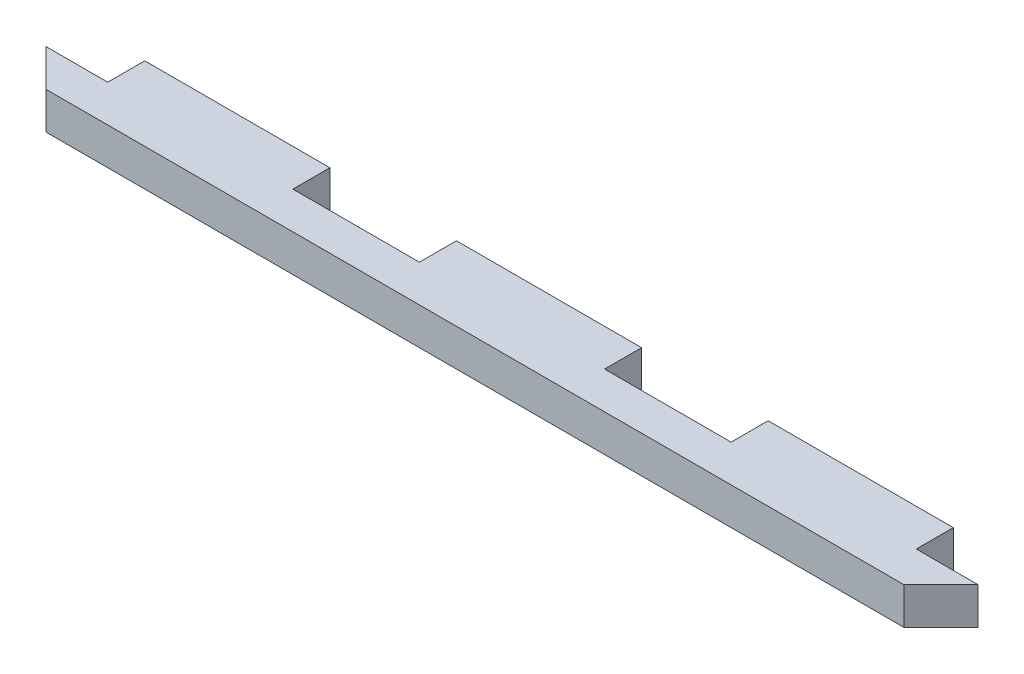
ISO-10303-21;
HEADER;
FILE_DESCRIPTION(('STEP AP214'),'2;1');
FILE_NAME('part.step','',(''),(''),'','','');
FILE_SCHEMA(('AUTOMOTIVE_DESIGN { 1 0 10303 214 1 1 1 1 }'));
ENDSEC;
DATA;
#1=APPLICATION_CONTEXT('core data for automotive mechanical design processes');
#2=APPLICATION_PROTOCOL_DEFINITION('international standard','automotive_design',2000,#1);
#3=PRODUCT_CONTEXT('',#1,'mechanical');
#4=PRODUCT('Part','Part','',(#3));
#5=PRODUCT_RELATED_PRODUCT_CATEGORY('part','',(#4));
#6=PRODUCT_DEFINITION_FORMATION('','',#4);
#7=PRODUCT_DEFINITION_CONTEXT('part definition',#1,'design');
#8=PRODUCT_DEFINITION('design','',#6,#7);
#9=PRODUCT_DEFINITION_SHAPE('','',#8);
#10=(LENGTH_UNIT() NAMED_UNIT(*) SI_UNIT(.MILLI.,.METRE.));
#11=(NAMED_UNIT(*) PLANE_ANGLE_UNIT() SI_UNIT($,.RADIAN.));
#12=(NAMED_UNIT(*) SI_UNIT($,.STERADIAN.) SOLID_ANGLE_UNIT());
#13=UNCERTAINTY_MEASURE_WITH_UNIT(LENGTH_MEASURE(1.E-05),#10,'distance_accuracy_value','');
#14=(GEOMETRIC_REPRESENTATION_CONTEXT(3) GLOBAL_UNCERTAINTY_ASSIGNED_CONTEXT((#13)) GLOBAL_UNIT_ASSIGNED_CONTEXT((#10,
#11,#12)) REPRESENTATION_CONTEXT('',''));
#15=CARTESIAN_POINT('',(0.,0.,0.));
#16=DIRECTION('',(0.,0.,1.));
#17=DIRECTION('',(1.,0.,0.));
#18=AXIS2_PLACEMENT_3D('',#15,#16,#17);
#19=CARTESIAN_POINT('',(0.,6.,-3.));
#20=DIRECTION('',(0.,0.,-1.));
#21=DIRECTION('',(-1.,0.,0.));
#22=AXIS2_PLACEMENT_3D('',#19,#20,#21);
#23=PLANE('',#22);
#24=DIRECTION('',(1.,0.,0.));
#25=VECTOR('',#24,1.);
#26=CARTESIAN_POINT('',(0.,0.,-3.));
#27=LINE('',#26,#25);
#28=CARTESIAN_POINT('',(-35.5,0.,-3.00000000000002));
#29=VERTEX_POINT('',#28);
#30=CARTESIAN_POINT('',(-15.,0.,-3.00000000000001));
#31=VERTEX_POINT('',#30);
#32=EDGE_CURVE('E268',#29,#31,#27,.T.);
#33=ORIENTED_EDGE('',*,*,#32,.F.);
#34=DIRECTION('',(0.,-1.,0.));
#35=VECTOR('',#34,1.);
#36=CARTESIAN_POINT('',(-35.5,36.5941170815567,-3.00000000000002));
#37=LINE('',#36,#35);
#38=CARTESIAN_POINT('',(-35.5,6.00000000000001,-3.00000000000002));
#39=VERTEX_POINT('',#38);
#40=EDGE_CURVE('E247',#39,#29,#37,.T.);
#41=ORIENTED_EDGE('',*,*,#40,.F.);
#42=DIRECTION('',(1.,0.,0.));
#43=VECTOR('',#42,1.);
#44=CARTESIAN_POINT('',(0.,6.,-3.));
#45=LINE('',#44,#43);
#46=CARTESIAN_POINT('',(-15.,6.00000000000001,-3.00000000000001));
#47=VERTEX_POINT('',#46);
#48=EDGE_CURVE('E179',#39,#47,#45,.T.);
#49=ORIENTED_EDGE('',*,*,#48,.T.);
#50=DIRECTION('',(0.,-1.,0.));
#51=VECTOR('',#50,1.);
#52=CARTESIAN_POINT('',(-15.,36.5941170815567,-3.00000000000001));
#53=LINE('',#52,#51);
#54=EDGE_CURVE('E215',#47,#31,#53,.T.);
#55=ORIENTED_EDGE('',*,*,#54,.T.);
#56=EDGE_LOOP('',(#33,#41,#49,#55));
#57=FACE_BOUND('',#56,.T.);
#58=ADVANCED_FACE('F39',(#57),#23,.T.);
#59=CARTESIAN_POINT('',(15.,0.,-2.99999999999999));
#60=VERTEX_POINT('',#59);
#61=CARTESIAN_POINT('',(35.5,0.,-2.99999999999998));
#62=VERTEX_POINT('',#61);
#63=EDGE_CURVE('E272',#60,#62,#27,.T.);
#64=ORIENTED_EDGE('',*,*,#63,.F.);
#65=DIRECTION('',(0.,-1.,0.));
#66=VECTOR('',#65,1.);
#67=CARTESIAN_POINT('',(15.,36.5941170815567,-2.99999999999999));
#68=LINE('',#67,#66);
#69=CARTESIAN_POINT('',(15.,6.00000000000001,-2.99999999999999));
#70=VERTEX_POINT('',#69);
#71=EDGE_CURVE('E232',#70,#60,#68,.T.);
#72=ORIENTED_EDGE('',*,*,#71,.F.);
#73=CARTESIAN_POINT('',(35.5,6.,-2.99999999999998));
#74=VERTEX_POINT('',#73);
#75=EDGE_CURVE('E184',#70,#74,#45,.T.);
#76=ORIENTED_EDGE('',*,*,#75,.T.);
#77=DIRECTION('',(0.,-1.,0.));
#78=VECTOR('',#77,1.);
#79=CARTESIAN_POINT('',(35.5,36.5941170815567,-2.99999999999998));
#80=LINE('',#79,#78);
#81=EDGE_CURVE('E196',#74,#62,#80,.T.);
#82=ORIENTED_EDGE('',*,*,#81,.T.);
#83=EDGE_LOOP('',(#64,#72,#76,#82));
#84=FACE_BOUND('',#83,.T.);
#85=ADVANCED_FACE('F304',(#84),#23,.T.);
#86=DIRECTION('',(0.,-1.,0.));
#87=VECTOR('',#86,1.);
#88=CARTESIAN_POINT('',(-65.5,36.5941170815567,-3.00000000000003));
#89=LINE('',#88,#87);
#90=CARTESIAN_POINT('',(-65.5,6.00000000000001,-3.00000000000003));
#91=VERTEX_POINT('',#90);
#92=CARTESIAN_POINT('',(-65.5,0.,-3.00000000000003));
#93=VERTEX_POINT('',#92);
#94=EDGE_CURVE('E152',#91,#93,#89,.T.);
#95=ORIENTED_EDGE('',*,*,#94,.T.);
#96=CARTESIAN_POINT('',(-75.5,0.,-3.00000000000004));
#97=VERTEX_POINT('',#96);
#98=EDGE_CURVE('E271',#97,#93,#27,.T.);
#99=ORIENTED_EDGE('',*,*,#98,.F.);
#100=DIRECTION('',(0.,-1.,0.));
#101=VECTOR('',#100,1.);
#102=CARTESIAN_POINT('',(-75.5,6.,-3.00000000000004));
#103=LINE('',#102,#101);
#104=CARTESIAN_POINT('',(-75.5,6.,-3.00000000000004));
#105=VERTEX_POINT('',#104);
#106=EDGE_CURVE('E176',#105,#97,#103,.T.);
#107=ORIENTED_EDGE('',*,*,#106,.F.);
#108=EDGE_CURVE('E170',#105,#91,#45,.T.);
#109=ORIENTED_EDGE('',*,*,#108,.T.);
#110=EDGE_LOOP('',(#95,#99,#107,#109));
#111=FACE_BOUND('',#110,.T.);
#112=ADVANCED_FACE('F175',(#111),#23,.T.);
#113=CARTESIAN_POINT('',(0.,6.,2.99999999999996));
#114=DIRECTION('',(0.,0.,-1.));
#115=DIRECTION('',(-1.,0.,0.));
#116=AXIS2_PLACEMENT_3D('',#113,#114,#115);
#117=PLANE('',#116);
#118=DIRECTION('',(1.,0.,0.));
#119=VECTOR('',#118,1.);
#120=CARTESIAN_POINT('',(0.,0.,2.99999999999996));
#121=LINE('',#120,#119);
#122=CARTESIAN_POINT('',(-69.5,0.,2.99999999999996));
#123=VERTEX_POINT('',#122);
#124=CARTESIAN_POINT('',(69.5000000000001,0.,2.99999999999996));
#125=VERTEX_POINT('',#124);
#126=EDGE_CURVE('E199',#123,#125,#121,.T.);
#127=ORIENTED_EDGE('',*,*,#126,.T.);
#128=DIRECTION('',(0.,-1.,0.));
#129=VECTOR('',#128,1.);
#130=CARTESIAN_POINT('',(69.5000000000001,6.,2.99999999999996));
#131=LINE('',#130,#129);
#132=CARTESIAN_POINT('',(69.5000000000001,6.,2.99999999999996));
#133=VERTEX_POINT('',#132);
#134=EDGE_CURVE('E11',#133,#125,#131,.T.);
#135=ORIENTED_EDGE('',*,*,#134,.F.);
#136=DIRECTION('',(1.,0.,0.));
#137=VECTOR('',#136,1.);
#138=CARTESIAN_POINT('',(0.,6.,2.99999999999996));
#139=LINE('',#138,#137);
#140=CARTESIAN_POINT('',(-69.5,6.,2.99999999999996));
#141=VERTEX_POINT('',#140);
#142=EDGE_CURVE('E191',#141,#133,#139,.T.);
#143=ORIENTED_EDGE('',*,*,#142,.F.);
#144=DIRECTION('',(0.,-1.,0.));
#145=VECTOR('',#144,1.);
#146=CARTESIAN_POINT('',(-69.5,6.,2.99999999999996));
#147=LINE('',#146,#145);
#148=EDGE_CURVE('E182',#141,#123,#147,.T.);
#149=ORIENTED_EDGE('',*,*,#148,.T.);
#150=EDGE_LOOP('',(#127,#135,#143,#149));
#151=FACE_BOUND('',#150,.T.);
#152=ADVANCED_FACE('F41',(#151),#117,.F.);
#153=CARTESIAN_POINT('',(36.25,6.,36.25));
#154=DIRECTION('',(-0.707106781186547,0.,-0.707106781186548));
#155=DIRECTION('',(-0.707106781186548,0.,0.707106781186547));
#156=AXIS2_PLACEMENT_3D('',#153,#154,#155);
#157=PLANE('',#156);
#158=DIRECTION('',(0.707106781186548,0.,-0.707106781186547));
#159=VECTOR('',#158,1.);
#160=CARTESIAN_POINT('',(36.25,0.,36.25));
#161=LINE('',#160,#159);
#162=CARTESIAN_POINT('',(75.5,0.,-2.99999999999996));
#163=VERTEX_POINT('',#162);
#164=EDGE_CURVE('E277',#125,#163,#161,.T.);
#165=ORIENTED_EDGE('',*,*,#164,.T.);
#166=DIRECTION('',(0.,-1.,0.));
#167=VECTOR('',#166,1.);
#168=CARTESIAN_POINT('',(75.5,6.,-2.99999999999996));
#169=LINE('',#168,#167);
#170=CARTESIAN_POINT('',(75.5,6.,-2.99999999999996));
#171=VERTEX_POINT('',#170);
#172=EDGE_CURVE('E47',#171,#163,#169,.T.);
#173=ORIENTED_EDGE('',*,*,#172,.F.);
#174=DIRECTION('',(0.707106781186548,0.,-0.707106781186547));
#175=VECTOR('',#174,1.);
#176=CARTESIAN_POINT('',(36.25,6.,36.25));
#177=LINE('',#176,#175);
#178=EDGE_CURVE('E186',#133,#171,#177,.T.);
#179=ORIENTED_EDGE('',*,*,#178,.F.);
#180=ORIENTED_EDGE('',*,*,#134,.T.);
#181=EDGE_LOOP('',(#165,#173,#179,#180));
#182=FACE_BOUND('',#181,.T.);
#183=ADVANCED_FACE('F285',(#182),#157,.F.);
#184=DIRECTION('',(0.,-1.,0.));
#185=VECTOR('',#184,1.);
#186=CARTESIAN_POINT('',(65.5,36.5941170815567,-2.99999999999997));
#187=LINE('',#186,#185);
#188=CARTESIAN_POINT('',(65.5,6.,-2.99999999999997));
#189=VERTEX_POINT('',#188);
#190=CARTESIAN_POINT('',(65.5,0.,-2.99999999999997));
#191=VERTEX_POINT('',#190);
#192=EDGE_CURVE('E207',#189,#191,#187,.T.);
#193=ORIENTED_EDGE('',*,*,#192,.F.);
#194=EDGE_CURVE('E181',#189,#171,#45,.T.);
#195=ORIENTED_EDGE('',*,*,#194,.T.);
#196=ORIENTED_EDGE('',*,*,#172,.T.);
#197=EDGE_CURVE('E274',#191,#163,#27,.T.);
#198=ORIENTED_EDGE('',*,*,#197,.F.);
#199=EDGE_LOOP('',(#193,#195,#196,#198));
#200=FACE_BOUND('',#199,.T.);
#201=ADVANCED_FACE('F283',(#200),#23,.T.);
#202=CARTESIAN_POINT('',(-36.25,6.,36.25));
#203=DIRECTION('',(0.707106781186548,0.,-0.707106781186548));
#204=DIRECTION('',(-0.707106781186548,0.,-0.707106781186548));
#205=AXIS2_PLACEMENT_3D('',#202,#203,#204);
#206=PLANE('',#205);
#207=DIRECTION('',(0.707106781186548,0.,0.707106781186547));
#208=VECTOR('',#207,1.);
#209=CARTESIAN_POINT('',(-36.25,0.,36.25));
#210=LINE('',#209,#208);
#211=EDGE_CURVE('E193',#97,#123,#210,.T.);
#212=ORIENTED_EDGE('',*,*,#211,.T.);
#213=ORIENTED_EDGE('',*,*,#148,.F.);
#214=DIRECTION('',(0.707106781186548,0.,0.707106781186547));
#215=VECTOR('',#214,1.);
#216=CARTESIAN_POINT('',(-36.25,6.,36.25));
#217=LINE('',#216,#215);
#218=EDGE_CURVE('E178',#105,#141,#217,.T.);
#219=ORIENTED_EDGE('',*,*,#218,.F.);
#220=ORIENTED_EDGE('',*,*,#106,.T.);
#221=EDGE_LOOP('',(#212,#213,#219,#220));
#222=FACE_BOUND('',#221,.T.);
#223=ADVANCED_FACE('F293',(#222),#206,.F.);
#224=CARTESIAN_POINT('',(0.,6.,0.));
#225=DIRECTION('',(0.,1.,0.));
#226=DIRECTION('',(0.,0.,1.));
#227=AXIS2_PLACEMENT_3D('',#224,#225,#226);
#228=PLANE('',#227);
#229=ORIENTED_EDGE('',*,*,#142,.T.);
#230=ORIENTED_EDGE('',*,*,#178,.T.);
#231=ORIENTED_EDGE('',*,*,#194,.F.);
#232=DIRECTION('',(0.,0.,-1.));
#233=VECTOR('',#232,1.);
#234=CARTESIAN_POINT('',(65.5,6.00000000000001,0.));
#235=LINE('',#234,#233);
#236=CARTESIAN_POINT('',(65.5,6.00000000000001,-9.00000000000004));
#237=VERTEX_POINT('',#236);
#238=EDGE_CURVE('E213',#189,#237,#235,.T.);
#239=ORIENTED_EDGE('',*,*,#238,.T.);
#240=DIRECTION('',(-1.,0.,0.));
#241=VECTOR('',#240,1.);
#242=CARTESIAN_POINT('',(0.,6.00000000000001,-9.00000000000004));
#243=LINE('',#242,#241);
#244=CARTESIAN_POINT('',(35.5,6.00000000000001,-9.00000000000004));
#245=VERTEX_POINT('',#244);
#246=EDGE_CURVE('E210',#237,#245,#243,.T.);
#247=ORIENTED_EDGE('',*,*,#246,.T.);
#248=DIRECTION('',(0.,0.,-1.));
#249=VECTOR('',#248,1.);
#250=CARTESIAN_POINT('',(35.5,6.00000000000001,0.));
#251=LINE('',#250,#249);
#252=EDGE_CURVE('E204',#74,#245,#251,.T.);
#253=ORIENTED_EDGE('',*,*,#252,.F.);
#254=ORIENTED_EDGE('',*,*,#75,.F.);
#255=DIRECTION('',(0.,0.,-1.));
#256=VECTOR('',#255,1.);
#257=CARTESIAN_POINT('',(15.,6.00000000000001,0.));
#258=LINE('',#257,#256);
#259=CARTESIAN_POINT('',(15.,6.00000000000001,-9.00000000000004));
#260=VERTEX_POINT('',#259);
#261=EDGE_CURVE('E237',#70,#260,#258,.T.);
#262=ORIENTED_EDGE('',*,*,#261,.T.);
#263=DIRECTION('',(-1.,0.,0.));
#264=VECTOR('',#263,1.);
#265=CARTESIAN_POINT('',(0.,6.00000000000001,-9.00000000000004));
#266=LINE('',#265,#264);
#267=CARTESIAN_POINT('',(-15.,6.00000000000001,-9.00000000000004));
#268=VERTEX_POINT('',#267);
#269=EDGE_CURVE('E234',#260,#268,#266,.T.);
#270=ORIENTED_EDGE('',*,*,#269,.T.);
#271=DIRECTION('',(0.,0.,-1.));
#272=VECTOR('',#271,1.);
#273=CARTESIAN_POINT('',(-15.,6.00000000000001,0.));
#274=LINE('',#273,#272);
#275=EDGE_CURVE('E229',#47,#268,#274,.T.);
#276=ORIENTED_EDGE('',*,*,#275,.F.);
#277=ORIENTED_EDGE('',*,*,#48,.F.);
#278=DIRECTION('',(0.,0.,-1.));
#279=VECTOR('',#278,1.);
#280=CARTESIAN_POINT('',(-35.5,6.00000000000001,0.));
#281=LINE('',#280,#279);
#282=CARTESIAN_POINT('',(-35.5,6.00000000000001,-9.00000000000005));
#283=VERTEX_POINT('',#282);
#284=EDGE_CURVE('E239',#39,#283,#281,.T.);
#285=ORIENTED_EDGE('',*,*,#284,.T.);
#286=DIRECTION('',(1.,0.,0.));
#287=VECTOR('',#286,1.);
#288=CARTESIAN_POINT('',(0.,6.00000000000001,-9.00000000000005));
#289=LINE('',#288,#287);
#290=CARTESIAN_POINT('',(-65.5,6.00000000000001,-9.00000000000005));
#291=VERTEX_POINT('',#290);
#292=EDGE_CURVE('E172',#291,#283,#289,.T.);
#293=ORIENTED_EDGE('',*,*,#292,.F.);
#294=DIRECTION('',(0.,0.,-1.));
#295=VECTOR('',#294,1.);
#296=CARTESIAN_POINT('',(-65.5,6.00000000000001,0.));
#297=LINE('',#296,#295);
#298=EDGE_CURVE('E155',#91,#291,#297,.T.);
#299=ORIENTED_EDGE('',*,*,#298,.F.);
#300=ORIENTED_EDGE('',*,*,#108,.F.);
#301=ORIENTED_EDGE('',*,*,#218,.T.);
#302=EDGE_LOOP('',(#229,#230,#231,#239,#247,#253,#254,#262,#270,#276,#277,#285,#293,#299,#300,#301));
#303=FACE_BOUND('',#302,.T.);
#304=ADVANCED_FACE('F169',(#303),#228,.T.);
#305=CARTESIAN_POINT('',(0.,0.,0.));
#306=DIRECTION('',(0.,1.,0.));
#307=DIRECTION('',(0.,0.,1.));
#308=AXIS2_PLACEMENT_3D('',#305,#306,#307);
#309=PLANE('',#308);
#310=ORIENTED_EDGE('',*,*,#126,.F.);
#311=ORIENTED_EDGE('',*,*,#211,.F.);
#312=ORIENTED_EDGE('',*,*,#98,.T.);
#313=DIRECTION('',(0.,0.,-1.));
#314=VECTOR('',#313,1.);
#315=CARTESIAN_POINT('',(-65.5,0.,0.));
#316=LINE('',#315,#314);
#317=CARTESIAN_POINT('',(-65.5,0.,-9.00000000000005));
#318=VERTEX_POINT('',#317);
#319=EDGE_CURVE('E158',#93,#318,#316,.T.);
#320=ORIENTED_EDGE('',*,*,#319,.T.);
#321=DIRECTION('',(1.,0.,0.));
#322=VECTOR('',#321,1.);
#323=CARTESIAN_POINT('',(0.,0.,-9.00000000000005));
#324=LINE('',#323,#322);
#325=CARTESIAN_POINT('',(-35.5,0.,-9.00000000000005));
#326=VERTEX_POINT('',#325);
#327=EDGE_CURVE('E252',#318,#326,#324,.T.);
#328=ORIENTED_EDGE('',*,*,#327,.T.);
#329=DIRECTION('',(0.,0.,-1.));
#330=VECTOR('',#329,1.);
#331=CARTESIAN_POINT('',(-35.5,0.,0.));
#332=LINE('',#331,#330);
#333=EDGE_CURVE('E54',#29,#326,#332,.T.);
#334=ORIENTED_EDGE('',*,*,#333,.F.);
#335=ORIENTED_EDGE('',*,*,#32,.T.);
#336=DIRECTION('',(0.,0.,-1.));
#337=VECTOR('',#336,1.);
#338=CARTESIAN_POINT('',(-15.,0.,0.));
#339=LINE('',#338,#337);
#340=CARTESIAN_POINT('',(-15.,0.,-9.00000000000004));
#341=VERTEX_POINT('',#340);
#342=EDGE_CURVE('E236',#31,#341,#339,.T.);
#343=ORIENTED_EDGE('',*,*,#342,.T.);
#344=DIRECTION('',(-1.,0.,0.));
#345=VECTOR('',#344,1.);
#346=CARTESIAN_POINT('',(0.,0.,-9.00000000000004));
#347=LINE('',#346,#345);
#348=CARTESIAN_POINT('',(15.,0.,-9.00000000000004));
#349=VERTEX_POINT('',#348);
#350=EDGE_CURVE('E231',#349,#341,#347,.T.);
#351=ORIENTED_EDGE('',*,*,#350,.F.);
#352=DIRECTION('',(0.,0.,-1.));
#353=VECTOR('',#352,1.);
#354=CARTESIAN_POINT('',(15.,0.,0.));
#355=LINE('',#354,#353);
#356=EDGE_CURVE('E61',#60,#349,#355,.T.);
#357=ORIENTED_EDGE('',*,*,#356,.F.);
#358=ORIENTED_EDGE('',*,*,#63,.T.);
#359=DIRECTION('',(0.,0.,-1.));
#360=VECTOR('',#359,1.);
#361=CARTESIAN_POINT('',(35.5,0.,0.));
#362=LINE('',#361,#360);
#363=CARTESIAN_POINT('',(35.5,0.,-9.00000000000004));
#364=VERTEX_POINT('',#363);
#365=EDGE_CURVE('E212',#62,#364,#362,.T.);
#366=ORIENTED_EDGE('',*,*,#365,.T.);
#367=DIRECTION('',(-1.,0.,0.));
#368=VECTOR('',#367,1.);
#369=CARTESIAN_POINT('',(0.,0.,-9.00000000000004));
#370=LINE('',#369,#368);
#371=CARTESIAN_POINT('',(65.5,0.,-9.00000000000004));
#372=VERTEX_POINT('',#371);
#373=EDGE_CURVE('E206',#372,#364,#370,.T.);
#374=ORIENTED_EDGE('',*,*,#373,.F.);
#375=DIRECTION('',(0.,0.,-1.));
#376=VECTOR('',#375,1.);
#377=CARTESIAN_POINT('',(65.5,0.,0.));
#378=LINE('',#377,#376);
#379=EDGE_CURVE('E200',#191,#372,#378,.T.);
#380=ORIENTED_EDGE('',*,*,#379,.F.);
#381=ORIENTED_EDGE('',*,*,#197,.T.);
#382=ORIENTED_EDGE('',*,*,#164,.F.);
#383=EDGE_LOOP('',(#310,#311,#312,#320,#328,#334,#335,#343,#351,#357,#358,#366,#374,#380,#381,#382));
#384=FACE_BOUND('',#383,.T.);
#385=ADVANCED_FACE('F258',(#384),#309,.F.);
#386=CARTESIAN_POINT('',(35.5,36.5941170815567,0.));
#387=DIRECTION('',(-1.,0.,0.));
#388=DIRECTION('',(0.,0.,1.));
#389=AXIS2_PLACEMENT_3D('',#386,#387,#388);
#390=PLANE('',#389);
#391=ORIENTED_EDGE('',*,*,#81,.F.);
#392=ORIENTED_EDGE('',*,*,#252,.T.);
#393=DIRECTION('',(0.,-1.,0.));
#394=VECTOR('',#393,1.);
#395=CARTESIAN_POINT('',(35.5,36.5941170815567,-9.00000000000004));
#396=LINE('',#395,#394);
#397=EDGE_CURVE('E201',#245,#364,#396,.T.);
#398=ORIENTED_EDGE('',*,*,#397,.T.);
#399=ORIENTED_EDGE('',*,*,#365,.F.);
#400=EDGE_LOOP('',(#391,#392,#398,#399));
#401=FACE_BOUND('',#400,.T.);
#402=ADVANCED_FACE('F366',(#401),#390,.T.);
#403=CARTESIAN_POINT('',(0.,36.5941170815567,-9.00000000000004));
#404=DIRECTION('',(0.,0.,1.));
#405=DIRECTION('',(1.,0.,0.));
#406=AXIS2_PLACEMENT_3D('',#403,#404,#405);
#407=PLANE('',#406);
#408=ORIENTED_EDGE('',*,*,#246,.F.);
#409=DIRECTION('',(0.,-1.,0.));
#410=VECTOR('',#409,1.);
#411=CARTESIAN_POINT('',(65.5,36.5941170815567,-9.00000000000004));
#412=LINE('',#411,#410);
#413=EDGE_CURVE('E203',#237,#372,#412,.T.);
#414=ORIENTED_EDGE('',*,*,#413,.T.);
#415=ORIENTED_EDGE('',*,*,#373,.T.);
#416=ORIENTED_EDGE('',*,*,#397,.F.);
#417=EDGE_LOOP('',(#408,#414,#415,#416));
#418=FACE_BOUND('',#417,.T.);
#419=ADVANCED_FACE('F401',(#418),#407,.F.);
#420=CARTESIAN_POINT('',(65.5,36.5941170815567,0.));
#421=DIRECTION('',(-1.,0.,0.));
#422=DIRECTION('',(0.,0.,1.));
#423=AXIS2_PLACEMENT_3D('',#420,#421,#422);
#424=PLANE('',#423);
#425=ORIENTED_EDGE('',*,*,#238,.F.);
#426=ORIENTED_EDGE('',*,*,#192,.T.);
#427=ORIENTED_EDGE('',*,*,#379,.T.);
#428=ORIENTED_EDGE('',*,*,#413,.F.);
#429=EDGE_LOOP('',(#425,#426,#427,#428));
#430=FACE_BOUND('',#429,.T.);
#431=ADVANCED_FACE('F412',(#430),#424,.F.);
#432=CARTESIAN_POINT('',(-15.,36.5941170815567,0.));
#433=DIRECTION('',(-1.,0.,0.));
#434=DIRECTION('',(0.,0.,1.));
#435=AXIS2_PLACEMENT_3D('',#432,#433,#434);
#436=PLANE('',#435);
#437=ORIENTED_EDGE('',*,*,#54,.F.);
#438=ORIENTED_EDGE('',*,*,#275,.T.);
#439=DIRECTION('',(0.,-1.,0.));
#440=VECTOR('',#439,1.);
#441=CARTESIAN_POINT('',(-15.,36.5941170815567,-9.00000000000004));
#442=LINE('',#441,#440);
#443=EDGE_CURVE('E226',#268,#341,#442,.T.);
#444=ORIENTED_EDGE('',*,*,#443,.T.);
#445=ORIENTED_EDGE('',*,*,#342,.F.);
#446=EDGE_LOOP('',(#437,#438,#444,#445));
#447=FACE_BOUND('',#446,.T.);
#448=ADVANCED_FACE('F423',(#447),#436,.T.);
#449=CARTESIAN_POINT('',(0.,36.5941170815567,-9.00000000000004));
#450=DIRECTION('',(0.,0.,1.));
#451=DIRECTION('',(1.,0.,0.));
#452=AXIS2_PLACEMENT_3D('',#449,#450,#451);
#453=PLANE('',#452);
#454=ORIENTED_EDGE('',*,*,#269,.F.);
#455=DIRECTION('',(0.,-1.,0.));
#456=VECTOR('',#455,1.);
#457=CARTESIAN_POINT('',(15.,36.5941170815567,-9.00000000000004));
#458=LINE('',#457,#456);
#459=EDGE_CURVE('E228',#260,#349,#458,.T.);
#460=ORIENTED_EDGE('',*,*,#459,.T.);
#461=ORIENTED_EDGE('',*,*,#350,.T.);
#462=ORIENTED_EDGE('',*,*,#443,.F.);
#463=EDGE_LOOP('',(#454,#460,#461,#462));
#464=FACE_BOUND('',#463,.T.);
#465=ADVANCED_FACE('F434',(#464),#453,.F.);
#466=CARTESIAN_POINT('',(15.,36.5941170815567,0.));
#467=DIRECTION('',(-1.,0.,0.));
#468=DIRECTION('',(0.,0.,1.));
#469=AXIS2_PLACEMENT_3D('',#466,#467,#468);
#470=PLANE('',#469);
#471=ORIENTED_EDGE('',*,*,#261,.F.);
#472=ORIENTED_EDGE('',*,*,#71,.T.);
#473=ORIENTED_EDGE('',*,*,#356,.T.);
#474=ORIENTED_EDGE('',*,*,#459,.F.);
#475=EDGE_LOOP('',(#471,#472,#473,#474));
#476=FACE_BOUND('',#475,.T.);
#477=ADVANCED_FACE('F445',(#476),#470,.F.);
#478=CARTESIAN_POINT('',(-35.5,36.5941170815567,0.));
#479=DIRECTION('',(-1.,0.,0.));
#480=DIRECTION('',(0.,0.,1.));
#481=AXIS2_PLACEMENT_3D('',#478,#479,#480);
#482=PLANE('',#481);
#483=ORIENTED_EDGE('',*,*,#284,.F.);
#484=ORIENTED_EDGE('',*,*,#40,.T.);
#485=ORIENTED_EDGE('',*,*,#333,.T.);
#486=DIRECTION('',(0.,-1.,0.));
#487=VECTOR('',#486,1.);
#488=CARTESIAN_POINT('',(-35.5,36.5941170815567,-9.00000000000005));
#489=LINE('',#488,#487);
#490=EDGE_CURVE('E173',#283,#326,#489,.T.);
#491=ORIENTED_EDGE('',*,*,#490,.F.);
#492=EDGE_LOOP('',(#483,#484,#485,#491));
#493=FACE_BOUND('',#492,.T.);
#494=ADVANCED_FACE('F263',(#493),#482,.F.);
#495=CARTESIAN_POINT('',(0.,36.5941170815567,-9.00000000000005));
#496=DIRECTION('',(0.,0.,-1.));
#497=DIRECTION('',(-1.,0.,0.));
#498=AXIS2_PLACEMENT_3D('',#495,#496,#497);
#499=PLANE('',#498);
#500=DIRECTION('',(0.,-1.,0.));
#501=VECTOR('',#500,1.);
#502=CARTESIAN_POINT('',(-65.5,36.5941170815567,-9.00000000000005));
#503=LINE('',#502,#501);
#504=EDGE_CURVE('E163',#291,#318,#503,.T.);
#505=ORIENTED_EDGE('',*,*,#504,.F.);
#506=ORIENTED_EDGE('',*,*,#292,.T.);
#507=ORIENTED_EDGE('',*,*,#490,.T.);
#508=ORIENTED_EDGE('',*,*,#327,.F.);
#509=EDGE_LOOP('',(#505,#506,#507,#508));
#510=FACE_BOUND('',#509,.T.);
#511=ADVANCED_FACE('F260',(#510),#499,.T.);
#512=CARTESIAN_POINT('',(-65.5,36.5941170815567,0.));
#513=DIRECTION('',(-1.,0.,0.));
#514=DIRECTION('',(0.,0.,1.));
#515=AXIS2_PLACEMENT_3D('',#512,#513,#514);
#516=PLANE('',#515);
#517=ORIENTED_EDGE('',*,*,#94,.F.);
#518=ORIENTED_EDGE('',*,*,#298,.T.);
#519=ORIENTED_EDGE('',*,*,#504,.T.);
#520=ORIENTED_EDGE('',*,*,#319,.F.);
#521=EDGE_LOOP('',(#517,#518,#519,#520));
#522=FACE_BOUND('',#521,.T.);
#523=ADVANCED_FACE('F154',(#522),#516,.T.);
#524=CLOSED_SHELL('',(#58,#85,#112,#152,#183,#201,#223,#304,#385,#402,#419,#431,#448,#465,#477,
#494,#511,#523));
#525=MANIFOLD_SOLID_BREP('B2',#524);
#526=ADVANCED_BREP_SHAPE_REPRESENTATION('',(#18,#525),#14);
#527=SHAPE_DEFINITION_REPRESENTATION(#9,#526);
ENDSEC;
END-ISO-10303-21;
